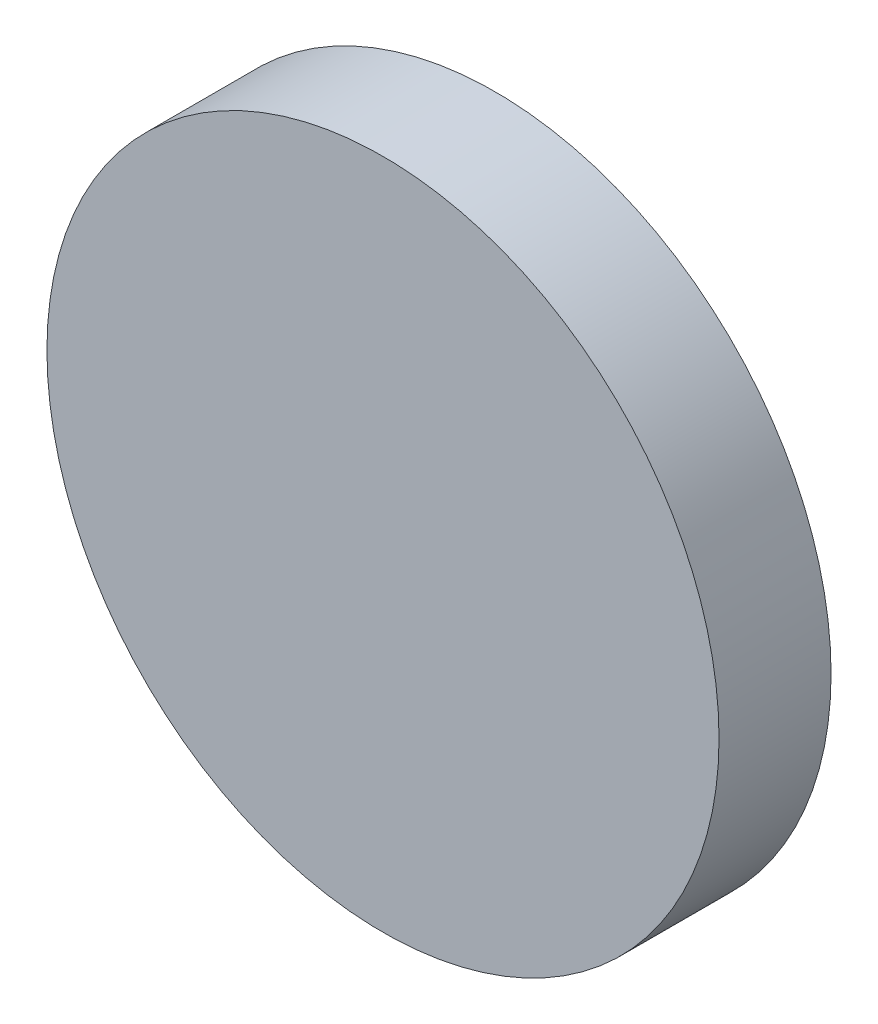
ISO-10303-21;
HEADER;
FILE_DESCRIPTION(('STEP AP214'),'2;1');
FILE_NAME('part.step','',(''),(''),'','','');
FILE_SCHEMA(('AUTOMOTIVE_DESIGN { 1 0 10303 214 1 1 1 1 }'));
ENDSEC;
DATA;
#1=APPLICATION_CONTEXT('core data for automotive mechanical design processes');
#2=APPLICATION_PROTOCOL_DEFINITION('international standard','automotive_design',2000,#1);
#3=PRODUCT_CONTEXT('',#1,'mechanical');
#4=PRODUCT('Part','Part','',(#3));
#5=PRODUCT_RELATED_PRODUCT_CATEGORY('part','',(#4));
#6=PRODUCT_DEFINITION_FORMATION('','',#4);
#7=PRODUCT_DEFINITION_CONTEXT('part definition',#1,'design');
#8=PRODUCT_DEFINITION('design','',#6,#7);
#9=PRODUCT_DEFINITION_SHAPE('','',#8);
#10=(LENGTH_UNIT() NAMED_UNIT(*) SI_UNIT(.MILLI.,.METRE.));
#11=(NAMED_UNIT(*) PLANE_ANGLE_UNIT() SI_UNIT($,.RADIAN.));
#12=(NAMED_UNIT(*) SI_UNIT($,.STERADIAN.) SOLID_ANGLE_UNIT());
#13=UNCERTAINTY_MEASURE_WITH_UNIT(LENGTH_MEASURE(1.E-05),#10,'distance_accuracy_value','');
#14=(GEOMETRIC_REPRESENTATION_CONTEXT(3) GLOBAL_UNCERTAINTY_ASSIGNED_CONTEXT((#13)) GLOBAL_UNIT_ASSIGNED_CONTEXT((#10,
#11,#12)) REPRESENTATION_CONTEXT('',''));
#15=CARTESIAN_POINT('',(0.,0.,0.));
#16=DIRECTION('',(0.,0.,1.));
#17=DIRECTION('',(1.,0.,0.));
#18=AXIS2_PLACEMENT_3D('',#15,#16,#17);
#19=CARTESIAN_POINT('',(0.,0.,2.));
#20=DIRECTION('',(0.,0.,-1.));
#21=DIRECTION('',(-1.,0.,0.));
#22=AXIS2_PLACEMENT_3D('',#19,#20,#21);
#23=CYLINDRICAL_SURFACE('',#22,6.);
#24=CARTESIAN_POINT('',(0.,0.,2.));
#25=DIRECTION('',(0.,0.,1.));
#26=DIRECTION('',(1.,0.,0.));
#27=AXIS2_PLACEMENT_3D('',#24,#25,#26);
#28=CIRCLE('',#27,6.);
#29=CARTESIAN_POINT('',(6.,0.,2.));
#30=VERTEX_POINT('',#29);
#31=EDGE_CURVE('E10',#30,#30,#28,.T.);
#32=ORIENTED_EDGE('',*,*,#31,.F.);
#33=EDGE_LOOP('',(#32));
#34=FACE_BOUND('',#33,.T.);
#35=CARTESIAN_POINT('',(0.,0.,0.));
#36=DIRECTION('',(0.,0.,1.));
#37=DIRECTION('',(1.,0.,0.));
#38=AXIS2_PLACEMENT_3D('',#35,#36,#37);
#39=CIRCLE('',#38,6.);
#40=CARTESIAN_POINT('',(6.,0.,0.));
#41=VERTEX_POINT('',#40);
#42=EDGE_CURVE('E33',#41,#41,#39,.T.);
#43=ORIENTED_EDGE('',*,*,#42,.T.);
#44=EDGE_LOOP('',(#43));
#45=FACE_BOUND('',#44,.T.);
#46=ADVANCED_FACE('F30',(#34,#45),#23,.T.);
#47=CARTESIAN_POINT('',(0.,0.,2.));
#48=DIRECTION('',(0.,0.,1.));
#49=DIRECTION('',(1.,0.,0.));
#50=AXIS2_PLACEMENT_3D('',#47,#48,#49);
#51=PLANE('',#50);
#52=ORIENTED_EDGE('',*,*,#31,.T.);
#53=EDGE_LOOP('',(#52));
#54=FACE_BOUND('',#53,.T.);
#55=ADVANCED_FACE('F45',(#54),#51,.T.);
#56=CARTESIAN_POINT('',(0.,0.,0.));
#57=DIRECTION('',(0.,0.,1.));
#58=DIRECTION('',(1.,0.,0.));
#59=AXIS2_PLACEMENT_3D('',#56,#57,#58);
#60=PLANE('',#59);
#61=ORIENTED_EDGE('',*,*,#42,.F.);
#62=EDGE_LOOP('',(#61));
#63=FACE_BOUND('',#62,.T.);
#64=ADVANCED_FACE('F43',(#63),#60,.F.);
#65=CLOSED_SHELL('',(#46,#55,#64));
#66=MANIFOLD_SOLID_BREP('B2',#65);
#67=ADVANCED_BREP_SHAPE_REPRESENTATION('',(#18,#66),#14);
#68=SHAPE_DEFINITION_REPRESENTATION(#9,#67);
ENDSEC;
END-ISO-10303-21;
